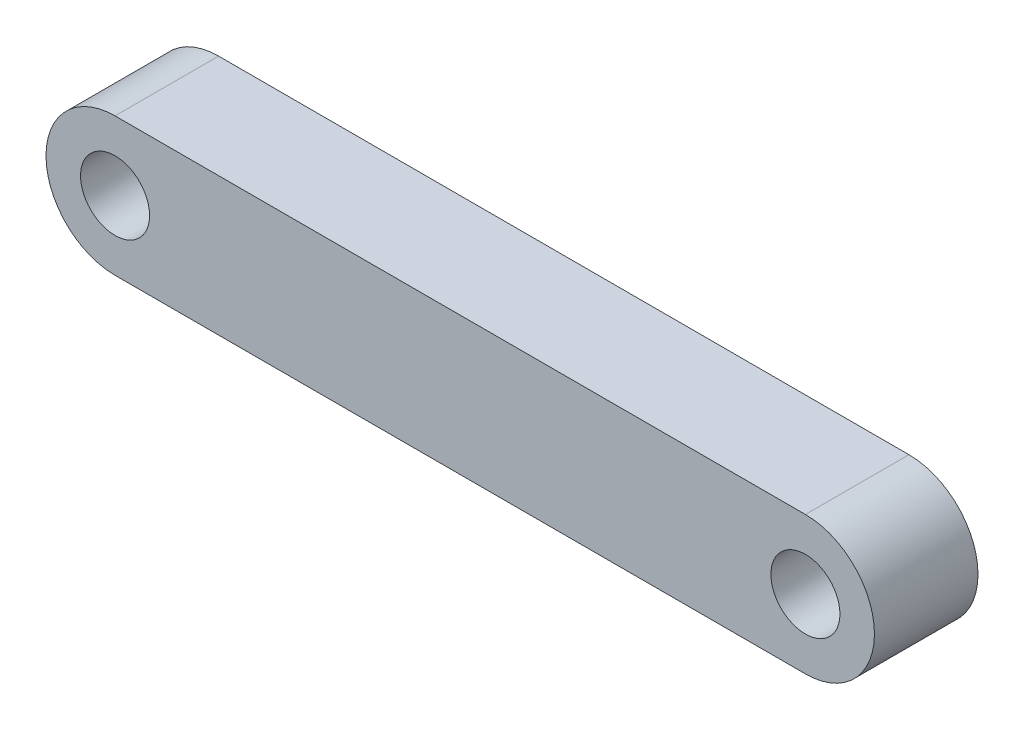
ISO-10303-21;
HEADER;
FILE_DESCRIPTION(('STEP AP214'),'2;1');
FILE_NAME('part.step','',(''),(''),'','','');
FILE_SCHEMA(('AUTOMOTIVE_DESIGN { 1 0 10303 214 1 1 1 1 }'));
ENDSEC;
DATA;
#1=APPLICATION_CONTEXT('core data for automotive mechanical design processes');
#2=APPLICATION_PROTOCOL_DEFINITION('international standard','automotive_design',2000,#1);
#3=PRODUCT_CONTEXT('',#1,'mechanical');
#4=PRODUCT('Part','Part','',(#3));
#5=PRODUCT_RELATED_PRODUCT_CATEGORY('part','',(#4));
#6=PRODUCT_DEFINITION_FORMATION('','',#4);
#7=PRODUCT_DEFINITION_CONTEXT('part definition',#1,'design');
#8=PRODUCT_DEFINITION('design','',#6,#7);
#9=PRODUCT_DEFINITION_SHAPE('','',#8);
#10=(LENGTH_UNIT() NAMED_UNIT(*) SI_UNIT(.MILLI.,.METRE.));
#11=(NAMED_UNIT(*) PLANE_ANGLE_UNIT() SI_UNIT($,.RADIAN.));
#12=(NAMED_UNIT(*) SI_UNIT($,.STERADIAN.) SOLID_ANGLE_UNIT());
#13=UNCERTAINTY_MEASURE_WITH_UNIT(LENGTH_MEASURE(1.E-05),#10,'distance_accuracy_value','');
#14=(GEOMETRIC_REPRESENTATION_CONTEXT(3) GLOBAL_UNCERTAINTY_ASSIGNED_CONTEXT((#13)) GLOBAL_UNIT_ASSIGNED_CONTEXT((#10,
#11,#12)) REPRESENTATION_CONTEXT('',''));
#15=CARTESIAN_POINT('',(0.,0.,0.));
#16=DIRECTION('',(0.,0.,1.));
#17=DIRECTION('',(1.,0.,0.));
#18=AXIS2_PLACEMENT_3D('',#15,#16,#17);
#19=CARTESIAN_POINT('',(0.,-10.,15.));
#20=DIRECTION('',(0.,0.,-1.));
#21=DIRECTION('',(-1.,0.,0.));
#22=AXIS2_PLACEMENT_3D('',#19,#20,#21);
#23=CYLINDRICAL_SURFACE('',#22,10.);
#24=CARTESIAN_POINT('',(0.,-10.,0.));
#25=DIRECTION('',(0.,0.,1.));
#26=DIRECTION('',(1.,0.,0.));
#27=AXIS2_PLACEMENT_3D('',#24,#25,#26);
#28=CIRCLE('',#27,10.);
#29=CARTESIAN_POINT('',(0.,0.,0.));
#30=VERTEX_POINT('',#29);
#31=CARTESIAN_POINT('',(0.,-20.,0.));
#32=VERTEX_POINT('',#31);
#33=EDGE_CURVE('E109',#30,#32,#28,.T.);
#34=ORIENTED_EDGE('',*,*,#33,.T.);
#35=DIRECTION('',(0.,0.,-1.));
#36=VECTOR('',#35,1.);
#37=CARTESIAN_POINT('',(0.,-20.,15.));
#38=LINE('',#37,#36);
#39=CARTESIAN_POINT('',(0.,-20.,15.));
#40=VERTEX_POINT('',#39);
#41=EDGE_CURVE('E11',#40,#32,#38,.T.);
#42=ORIENTED_EDGE('',*,*,#41,.F.);
#43=CARTESIAN_POINT('',(0.,-10.,15.));
#44=DIRECTION('',(0.,0.,1.));
#45=DIRECTION('',(1.,0.,0.));
#46=AXIS2_PLACEMENT_3D('',#43,#44,#45);
#47=CIRCLE('',#46,10.);
#48=CARTESIAN_POINT('',(0.,0.,15.));
#49=VERTEX_POINT('',#48);
#50=EDGE_CURVE('E89',#49,#40,#47,.T.);
#51=ORIENTED_EDGE('',*,*,#50,.F.);
#52=DIRECTION('',(0.,0.,-1.));
#53=VECTOR('',#52,1.);
#54=CARTESIAN_POINT('',(0.,0.,15.));
#55=LINE('',#54,#53);
#56=EDGE_CURVE('E55',#49,#30,#55,.T.);
#57=ORIENTED_EDGE('',*,*,#56,.T.);
#58=EDGE_LOOP('',(#34,#42,#51,#57));
#59=FACE_BOUND('',#58,.T.);
#60=ADVANCED_FACE('F38',(#59),#23,.T.);
#61=CARTESIAN_POINT('',(0.,-20.,15.));
#62=DIRECTION('',(0.,1.,0.));
#63=DIRECTION('',(0.,0.,1.));
#64=AXIS2_PLACEMENT_3D('',#61,#62,#63);
#65=PLANE('',#64);
#66=DIRECTION('',(1.,0.,0.));
#67=VECTOR('',#66,1.);
#68=CARTESIAN_POINT('',(0.,-20.,0.));
#69=LINE('',#68,#67);
#70=CARTESIAN_POINT('',(100.,-20.,0.));
#71=VERTEX_POINT('',#70);
#72=EDGE_CURVE('E94',#32,#71,#69,.T.);
#73=ORIENTED_EDGE('',*,*,#72,.T.);
#74=DIRECTION('',(0.,0.,-1.));
#75=VECTOR('',#74,1.);
#76=CARTESIAN_POINT('',(100.,-20.,15.));
#77=LINE('',#76,#75);
#78=CARTESIAN_POINT('',(100.,-20.,15.));
#79=VERTEX_POINT('',#78);
#80=EDGE_CURVE('E47',#79,#71,#77,.T.);
#81=ORIENTED_EDGE('',*,*,#80,.F.);
#82=DIRECTION('',(1.,0.,0.));
#83=VECTOR('',#82,1.);
#84=CARTESIAN_POINT('',(0.,-20.,15.));
#85=LINE('',#84,#83);
#86=EDGE_CURVE('E81',#40,#79,#85,.T.);
#87=ORIENTED_EDGE('',*,*,#86,.F.);
#88=ORIENTED_EDGE('',*,*,#41,.T.);
#89=EDGE_LOOP('',(#73,#81,#87,#88));
#90=FACE_BOUND('',#89,.T.);
#91=ADVANCED_FACE('F93',(#90),#65,.F.);
#92=CARTESIAN_POINT('',(100.,-10.,15.));
#93=DIRECTION('',(0.,0.,-1.));
#94=DIRECTION('',(-1.,0.,0.));
#95=AXIS2_PLACEMENT_3D('',#92,#93,#94);
#96=CYLINDRICAL_SURFACE('',#95,10.);
#97=CARTESIAN_POINT('',(100.,-10.,0.));
#98=DIRECTION('',(0.,0.,1.));
#99=DIRECTION('',(1.,0.,0.));
#100=AXIS2_PLACEMENT_3D('',#97,#98,#99);
#101=CIRCLE('',#100,10.);
#102=CARTESIAN_POINT('',(100.,0.,0.));
#103=VERTEX_POINT('',#102);
#104=EDGE_CURVE('E112',#71,#103,#101,.T.);
#105=ORIENTED_EDGE('',*,*,#104,.T.);
#106=DIRECTION('',(0.,0.,-1.));
#107=VECTOR('',#106,1.);
#108=CARTESIAN_POINT('',(100.,0.,15.));
#109=LINE('',#108,#107);
#110=CARTESIAN_POINT('',(100.,0.,15.));
#111=VERTEX_POINT('',#110);
#112=EDGE_CURVE('E70',#111,#103,#109,.T.);
#113=ORIENTED_EDGE('',*,*,#112,.F.);
#114=CARTESIAN_POINT('',(100.,-10.,15.));
#115=DIRECTION('',(0.,0.,1.));
#116=DIRECTION('',(1.,0.,0.));
#117=AXIS2_PLACEMENT_3D('',#114,#115,#116);
#118=CIRCLE('',#117,10.);
#119=EDGE_CURVE('E88',#79,#111,#118,.T.);
#120=ORIENTED_EDGE('',*,*,#119,.F.);
#121=ORIENTED_EDGE('',*,*,#80,.T.);
#122=EDGE_LOOP('',(#105,#113,#120,#121));
#123=FACE_BOUND('',#122,.T.);
#124=ADVANCED_FACE('F97',(#123),#96,.T.);
#125=CARTESIAN_POINT('',(0.,0.,15.));
#126=DIRECTION('',(0.,1.,0.));
#127=DIRECTION('',(0.,0.,1.));
#128=AXIS2_PLACEMENT_3D('',#125,#126,#127);
#129=PLANE('',#128);
#130=DIRECTION('',(1.,0.,0.));
#131=VECTOR('',#130,1.);
#132=CARTESIAN_POINT('',(0.,0.,0.));
#133=LINE('',#132,#131);
#134=EDGE_CURVE('E114',#30,#103,#133,.T.);
#135=ORIENTED_EDGE('',*,*,#134,.F.);
#136=ORIENTED_EDGE('',*,*,#56,.F.);
#137=DIRECTION('',(1.,0.,0.));
#138=VECTOR('',#137,1.);
#139=CARTESIAN_POINT('',(0.,0.,15.));
#140=LINE('',#139,#138);
#141=EDGE_CURVE('E98',#49,#111,#140,.T.);
#142=ORIENTED_EDGE('',*,*,#141,.T.);
#143=ORIENTED_EDGE('',*,*,#112,.T.);
#144=EDGE_LOOP('',(#135,#136,#142,#143));
#145=FACE_BOUND('',#144,.T.);
#146=ADVANCED_FACE('F150',(#145),#129,.T.);
#147=CARTESIAN_POINT('',(100.,-10.,15.));
#148=DIRECTION('',(0.,0.,-1.));
#149=DIRECTION('',(-1.,0.,0.));
#150=AXIS2_PLACEMENT_3D('',#147,#148,#149);
#151=CYLINDRICAL_SURFACE('',#150,5.);
#152=CARTESIAN_POINT('',(100.,-10.,15.));
#153=DIRECTION('',(0.,0.,1.));
#154=DIRECTION('',(1.,0.,0.));
#155=AXIS2_PLACEMENT_3D('',#152,#153,#154);
#156=CIRCLE('',#155,5.);
#157=CARTESIAN_POINT('',(105.,-10.,15.));
#158=VERTEX_POINT('',#157);
#159=EDGE_CURVE('E120',#158,#158,#156,.T.);
#160=ORIENTED_EDGE('',*,*,#159,.T.);
#161=EDGE_LOOP('',(#160));
#162=FACE_BOUND('',#161,.T.);
#163=CARTESIAN_POINT('',(100.,-10.,0.));
#164=DIRECTION('',(0.,0.,1.));
#165=DIRECTION('',(1.,0.,0.));
#166=AXIS2_PLACEMENT_3D('',#163,#164,#165);
#167=CIRCLE('',#166,5.);
#168=CARTESIAN_POINT('',(105.,-10.,0.));
#169=VERTEX_POINT('',#168);
#170=EDGE_CURVE('E106',#169,#169,#167,.T.);
#171=ORIENTED_EDGE('',*,*,#170,.F.);
#172=EDGE_LOOP('',(#171));
#173=FACE_BOUND('',#172,.T.);
#174=ADVANCED_FACE('F40',(#162,#173),#151,.F.);
#175=CARTESIAN_POINT('',(0.,-10.,15.));
#176=DIRECTION('',(0.,0.,-1.));
#177=DIRECTION('',(-1.,0.,0.));
#178=AXIS2_PLACEMENT_3D('',#175,#176,#177);
#179=CYLINDRICAL_SURFACE('',#178,5.);
#180=CARTESIAN_POINT('',(0.,-10.,15.));
#181=DIRECTION('',(0.,0.,1.));
#182=DIRECTION('',(1.,0.,0.));
#183=AXIS2_PLACEMENT_3D('',#180,#181,#182);
#184=CIRCLE('',#183,5.);
#185=CARTESIAN_POINT('',(5.,-10.,15.));
#186=VERTEX_POINT('',#185);
#187=EDGE_CURVE('E100',#186,#186,#184,.T.);
#188=ORIENTED_EDGE('',*,*,#187,.T.);
#189=EDGE_LOOP('',(#188));
#190=FACE_BOUND('',#189,.T.);
#191=CARTESIAN_POINT('',(0.,-10.,0.));
#192=DIRECTION('',(0.,0.,1.));
#193=DIRECTION('',(1.,0.,0.));
#194=AXIS2_PLACEMENT_3D('',#191,#192,#193);
#195=CIRCLE('',#194,5.);
#196=CARTESIAN_POINT('',(5.,-10.,0.));
#197=VERTEX_POINT('',#196);
#198=EDGE_CURVE('E117',#197,#197,#195,.T.);
#199=ORIENTED_EDGE('',*,*,#198,.F.);
#200=EDGE_LOOP('',(#199));
#201=FACE_BOUND('',#200,.T.);
#202=ADVANCED_FACE('F132',(#190,#201),#179,.F.);
#203=CARTESIAN_POINT('',(0.,0.,15.));
#204=DIRECTION('',(0.,0.,1.));
#205=DIRECTION('',(1.,0.,0.));
#206=AXIS2_PLACEMENT_3D('',#203,#204,#205);
#207=PLANE('',#206);
#208=ORIENTED_EDGE('',*,*,#159,.F.);
#209=EDGE_LOOP('',(#208));
#210=FACE_BOUND('',#209,.T.);
#211=ORIENTED_EDGE('',*,*,#50,.T.);
#212=ORIENTED_EDGE('',*,*,#86,.T.);
#213=ORIENTED_EDGE('',*,*,#119,.T.);
#214=ORIENTED_EDGE('',*,*,#141,.F.);
#215=EDGE_LOOP('',(#211,#212,#213,#214));
#216=FACE_BOUND('',#215,.T.);
#217=ORIENTED_EDGE('',*,*,#187,.F.);
#218=EDGE_LOOP('',(#217));
#219=FACE_BOUND('',#218,.T.);
#220=ADVANCED_FACE('F84',(#210,#216,#219),#207,.T.);
#221=CARTESIAN_POINT('',(0.,0.,0.));
#222=DIRECTION('',(0.,0.,1.));
#223=DIRECTION('',(1.,0.,0.));
#224=AXIS2_PLACEMENT_3D('',#221,#222,#223);
#225=PLANE('',#224);
#226=ORIENTED_EDGE('',*,*,#170,.T.);
#227=EDGE_LOOP('',(#226));
#228=FACE_BOUND('',#227,.T.);
#229=ORIENTED_EDGE('',*,*,#33,.F.);
#230=ORIENTED_EDGE('',*,*,#134,.T.);
#231=ORIENTED_EDGE('',*,*,#104,.F.);
#232=ORIENTED_EDGE('',*,*,#72,.F.);
#233=EDGE_LOOP('',(#229,#230,#231,#232));
#234=FACE_BOUND('',#233,.T.);
#235=ORIENTED_EDGE('',*,*,#198,.T.);
#236=EDGE_LOOP('',(#235));
#237=FACE_BOUND('',#236,.T.);
#238=ADVANCED_FACE('F131',(#228,#234,#237),#225,.F.);
#239=CLOSED_SHELL('',(#60,#91,#124,#146,#174,#202,#220,#238));
#240=MANIFOLD_SOLID_BREP('B2',#239);
#241=ADVANCED_BREP_SHAPE_REPRESENTATION('',(#18,#240),#14);
#242=SHAPE_DEFINITION_REPRESENTATION(#9,#241);
ENDSEC;
END-ISO-10303-21;
